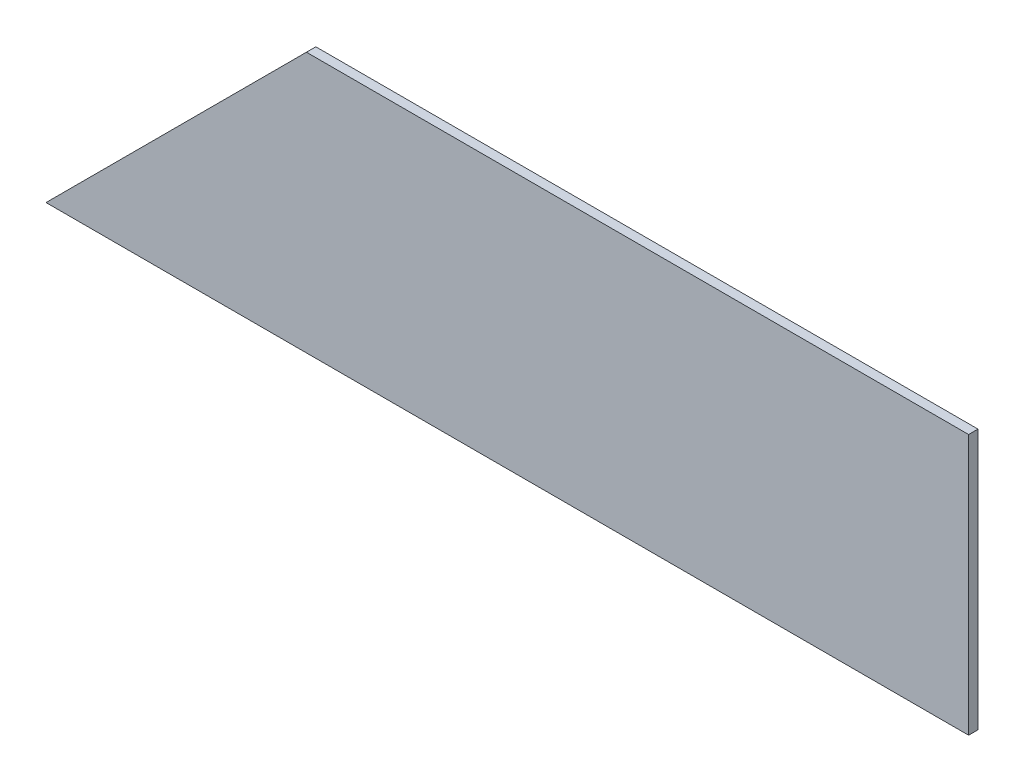
ISO-10303-21;
HEADER;
FILE_DESCRIPTION(('STEP AP214'),'2;1');
FILE_NAME('part.step','',(''),(''),'','','');
FILE_SCHEMA(('AUTOMOTIVE_DESIGN { 1 0 10303 214 1 1 1 1 }'));
ENDSEC;
DATA;
#1=APPLICATION_CONTEXT('core data for automotive mechanical design processes');
#2=APPLICATION_PROTOCOL_DEFINITION('international standard','automotive_design',2000,#1);
#3=PRODUCT_CONTEXT('',#1,'mechanical');
#4=PRODUCT('Part','Part','',(#3));
#5=PRODUCT_RELATED_PRODUCT_CATEGORY('part','',(#4));
#6=PRODUCT_DEFINITION_FORMATION('','',#4);
#7=PRODUCT_DEFINITION_CONTEXT('part definition',#1,'design');
#8=PRODUCT_DEFINITION('design','',#6,#7);
#9=PRODUCT_DEFINITION_SHAPE('','',#8);
#10=(LENGTH_UNIT() NAMED_UNIT(*) SI_UNIT(.MILLI.,.METRE.));
#11=(NAMED_UNIT(*) PLANE_ANGLE_UNIT() SI_UNIT($,.RADIAN.));
#12=(NAMED_UNIT(*) SI_UNIT($,.STERADIAN.) SOLID_ANGLE_UNIT());
#13=UNCERTAINTY_MEASURE_WITH_UNIT(LENGTH_MEASURE(1.E-05),#10,'distance_accuracy_value','');
#14=(GEOMETRIC_REPRESENTATION_CONTEXT(3) GLOBAL_UNCERTAINTY_ASSIGNED_CONTEXT((#13)) GLOBAL_UNIT_ASSIGNED_CONTEXT((#10,
#11,#12)) REPRESENTATION_CONTEXT('',''));
#15=CARTESIAN_POINT('',(0.,0.,0.));
#16=DIRECTION('',(0.,0.,1.));
#17=DIRECTION('',(1.,0.,0.));
#18=AXIS2_PLACEMENT_3D('',#15,#16,#17);
#19=CARTESIAN_POINT('',(499.657382068711,360.,-3.));
#20=DIRECTION('',(-0.707106781186548,0.707106781186547,0.));
#21=DIRECTION('',(-0.707106781186547,-0.707106781186548,0.));
#22=AXIS2_PLACEMENT_3D('',#19,#20,#21);
#23=PLANE('',#22);
#24=DIRECTION('',(-0.707106781186547,-0.707106781186548,0.));
#25=VECTOR('',#24,1.);
#26=CARTESIAN_POINT('',(499.657382068711,360.,0.));
#27=LINE('',#26,#25);
#28=CARTESIAN_POINT('',(499.657382068711,360.,0.));
#29=VERTEX_POINT('',#28);
#30=CARTESIAN_POINT('',(416.466548048329,276.809165979618,0.));
#31=VERTEX_POINT('',#30);
#32=EDGE_CURVE('E98',#29,#31,#27,.T.);
#33=ORIENTED_EDGE('',*,*,#32,.F.);
#34=DIRECTION('',(0.,0.,1.));
#35=VECTOR('',#34,1.);
#36=CARTESIAN_POINT('',(499.657382068711,360.,-3.));
#37=LINE('',#36,#35);
#38=CARTESIAN_POINT('',(499.657382068711,360.,-3.));
#39=VERTEX_POINT('',#38);
#40=EDGE_CURVE('E11',#39,#29,#37,.T.);
#41=ORIENTED_EDGE('',*,*,#40,.F.);
#42=DIRECTION('',(-0.707106781186547,-0.707106781186548,0.));
#43=VECTOR('',#42,1.);
#44=CARTESIAN_POINT('',(499.657382068711,360.,-3.));
#45=LINE('',#44,#43);
#46=CARTESIAN_POINT('',(416.466548048329,276.809165979618,-3.));
#47=VERTEX_POINT('',#46);
#48=EDGE_CURVE('E92',#39,#47,#45,.T.);
#49=ORIENTED_EDGE('',*,*,#48,.T.);
#50=DIRECTION('',(0.,0.,1.));
#51=VECTOR('',#50,1.);
#52=CARTESIAN_POINT('',(416.466548048329,276.809165979618,-3.));
#53=LINE('',#52,#51);
#54=EDGE_CURVE('E37',#47,#31,#53,.T.);
#55=ORIENTED_EDGE('',*,*,#54,.T.);
#56=EDGE_LOOP('',(#33,#41,#49,#55));
#57=FACE_BOUND('',#56,.T.);
#58=ADVANCED_FACE('F34',(#57),#23,.T.);
#59=CARTESIAN_POINT('',(711.176734530374,360.,-3.));
#60=DIRECTION('',(0.,1.,0.));
#61=DIRECTION('',(-1.,0.,0.));
#62=AXIS2_PLACEMENT_3D('',#59,#60,#61);
#63=PLANE('',#62);
#64=DIRECTION('',(-1.,0.,0.));
#65=VECTOR('',#64,1.);
#66=CARTESIAN_POINT('',(711.176734530374,360.,0.));
#67=LINE('',#66,#65);
#68=CARTESIAN_POINT('',(711.176734530374,360.,0.));
#69=VERTEX_POINT('',#68);
#70=EDGE_CURVE('E94',#69,#29,#67,.T.);
#71=ORIENTED_EDGE('',*,*,#70,.F.);
#72=DIRECTION('',(0.,0.,1.));
#73=VECTOR('',#72,1.);
#74=CARTESIAN_POINT('',(711.176734530374,360.,-3.));
#75=LINE('',#74,#73);
#76=CARTESIAN_POINT('',(711.176734530374,360.,-3.));
#77=VERTEX_POINT('',#76);
#78=EDGE_CURVE('E43',#77,#69,#75,.T.);
#79=ORIENTED_EDGE('',*,*,#78,.F.);
#80=DIRECTION('',(-1.,0.,0.));
#81=VECTOR('',#80,1.);
#82=CARTESIAN_POINT('',(711.176734530374,360.,-3.));
#83=LINE('',#82,#81);
#84=EDGE_CURVE('E89',#77,#39,#83,.T.);
#85=ORIENTED_EDGE('',*,*,#84,.T.);
#86=ORIENTED_EDGE('',*,*,#40,.T.);
#87=EDGE_LOOP('',(#71,#79,#85,#86));
#88=FACE_BOUND('',#87,.T.);
#89=ADVANCED_FACE('F108',(#88),#63,.T.);
#90=CARTESIAN_POINT('',(711.176734530374,276.809165979618,-3.));
#91=DIRECTION('',(1.,0.,0.));
#92=DIRECTION('',(0.,0.,-1.));
#93=AXIS2_PLACEMENT_3D('',#90,#91,#92);
#94=PLANE('',#93);
#95=DIRECTION('',(0.,1.,0.));
#96=VECTOR('',#95,1.);
#97=CARTESIAN_POINT('',(711.176734530374,276.809165979618,0.));
#98=LINE('',#97,#96);
#99=CARTESIAN_POINT('',(711.176734530374,276.809165979618,0.));
#100=VERTEX_POINT('',#99);
#101=EDGE_CURVE('E84',#100,#69,#98,.T.);
#102=ORIENTED_EDGE('',*,*,#101,.F.);
#103=DIRECTION('',(0.,0.,1.));
#104=VECTOR('',#103,1.);
#105=CARTESIAN_POINT('',(711.176734530374,276.809165979618,-3.));
#106=LINE('',#105,#104);
#107=CARTESIAN_POINT('',(711.176734530374,276.809165979618,-3.));
#108=VERTEX_POINT('',#107);
#109=EDGE_CURVE('E79',#108,#100,#106,.T.);
#110=ORIENTED_EDGE('',*,*,#109,.F.);
#111=DIRECTION('',(0.,1.,0.));
#112=VECTOR('',#111,1.);
#113=CARTESIAN_POINT('',(711.176734530374,276.809165979618,-3.));
#114=LINE('',#113,#112);
#115=EDGE_CURVE('E82',#108,#77,#114,.T.);
#116=ORIENTED_EDGE('',*,*,#115,.T.);
#117=ORIENTED_EDGE('',*,*,#78,.T.);
#118=EDGE_LOOP('',(#102,#110,#116,#117));
#119=FACE_BOUND('',#118,.T.);
#120=ADVANCED_FACE('F81',(#119),#94,.T.);
#121=CARTESIAN_POINT('',(416.466548048329,276.809165979618,-3.));
#122=DIRECTION('',(0.,-1.,0.));
#123=DIRECTION('',(0.,0.,-1.));
#124=AXIS2_PLACEMENT_3D('',#121,#122,#123);
#125=PLANE('',#124);
#126=DIRECTION('',(1.,0.,0.));
#127=VECTOR('',#126,1.);
#128=CARTESIAN_POINT('',(416.466548048329,276.809165979618,0.));
#129=LINE('',#128,#127);
#130=EDGE_CURVE('E101',#31,#100,#129,.T.);
#131=ORIENTED_EDGE('',*,*,#130,.F.);
#132=ORIENTED_EDGE('',*,*,#54,.F.);
#133=DIRECTION('',(1.,0.,0.));
#134=VECTOR('',#133,1.);
#135=CARTESIAN_POINT('',(416.466548048329,276.809165979618,-3.));
#136=LINE('',#135,#134);
#137=EDGE_CURVE('E88',#47,#108,#136,.T.);
#138=ORIENTED_EDGE('',*,*,#137,.T.);
#139=ORIENTED_EDGE('',*,*,#109,.T.);
#140=EDGE_LOOP('',(#131,#132,#138,#139));
#141=FACE_BOUND('',#140,.T.);
#142=ADVANCED_FACE('F91',(#141),#125,.T.);
#143=CARTESIAN_POINT('',(0.,0.,-3.));
#144=DIRECTION('',(0.,0.,1.));
#145=DIRECTION('',(1.,0.,0.));
#146=AXIS2_PLACEMENT_3D('',#143,#144,#145);
#147=PLANE('',#146);
#148=ORIENTED_EDGE('',*,*,#48,.F.);
#149=ORIENTED_EDGE('',*,*,#84,.F.);
#150=ORIENTED_EDGE('',*,*,#115,.F.);
#151=ORIENTED_EDGE('',*,*,#137,.F.);
#152=EDGE_LOOP('',(#148,#149,#150,#151));
#153=FACE_BOUND('',#152,.T.);
#154=ADVANCED_FACE('F87',(#153),#147,.F.);
#155=CARTESIAN_POINT('',(0.,0.,0.));
#156=DIRECTION('',(0.,0.,1.));
#157=DIRECTION('',(1.,0.,0.));
#158=AXIS2_PLACEMENT_3D('',#155,#156,#157);
#159=PLANE('',#158);
#160=ORIENTED_EDGE('',*,*,#32,.T.);
#161=ORIENTED_EDGE('',*,*,#130,.T.);
#162=ORIENTED_EDGE('',*,*,#101,.T.);
#163=ORIENTED_EDGE('',*,*,#70,.T.);
#164=EDGE_LOOP('',(#160,#161,#162,#163));
#165=FACE_BOUND('',#164,.T.);
#166=ADVANCED_FACE('F107',(#165),#159,.T.);
#167=CLOSED_SHELL('',(#58,#89,#120,#142,#154,#166));
#168=MANIFOLD_SOLID_BREP('B2',#167);
#169=ADVANCED_BREP_SHAPE_REPRESENTATION('',(#18,#168),#14);
#170=SHAPE_DEFINITION_REPRESENTATION(#9,#169);
ENDSEC;
END-ISO-10303-21;
